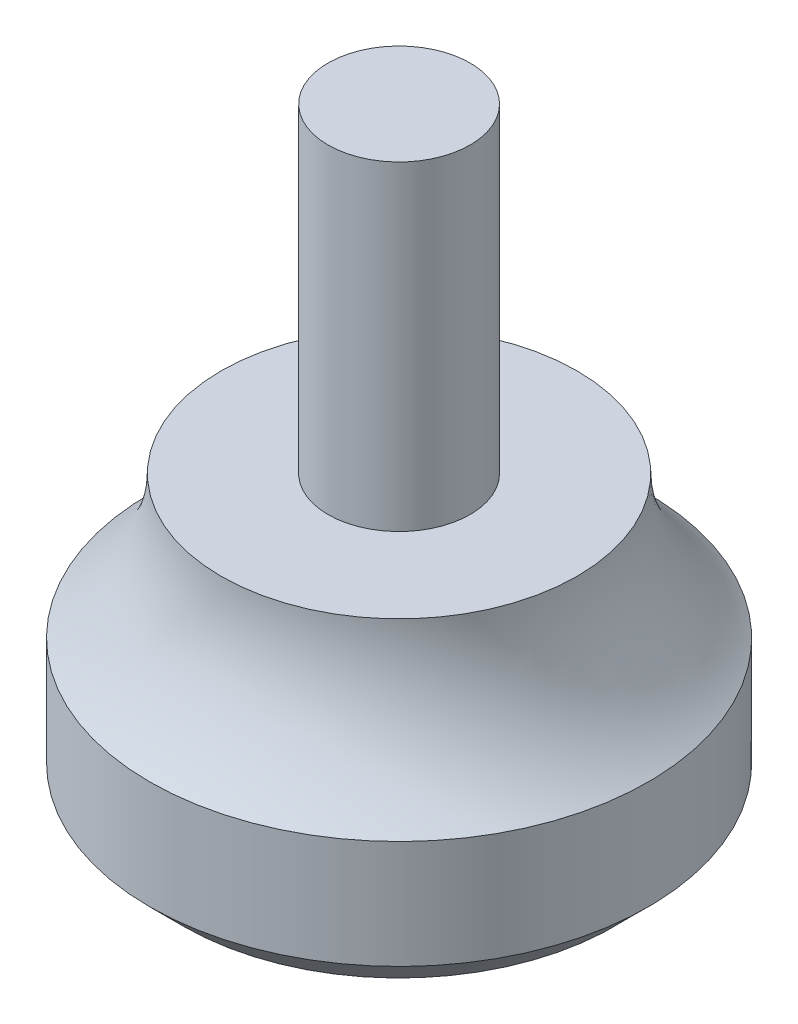
ISO-10303-21;
HEADER;
FILE_DESCRIPTION(('STEP AP214'),'2;1');
FILE_NAME('part.step','',(''),(''),'','','');
FILE_SCHEMA(('AUTOMOTIVE_DESIGN { 1 0 10303 214 1 1 1 1 }'));
ENDSEC;
DATA;
#1=APPLICATION_CONTEXT('core data for automotive mechanical design processes');
#2=APPLICATION_PROTOCOL_DEFINITION('international standard','automotive_design',2000,#1);
#3=PRODUCT_CONTEXT('',#1,'mechanical');
#4=PRODUCT('Part','Part','',(#3));
#5=PRODUCT_RELATED_PRODUCT_CATEGORY('part','',(#4));
#6=PRODUCT_DEFINITION_FORMATION('','',#4);
#7=PRODUCT_DEFINITION_CONTEXT('part definition',#1,'design');
#8=PRODUCT_DEFINITION('design','',#6,#7);
#9=PRODUCT_DEFINITION_SHAPE('','',#8);
#10=(LENGTH_UNIT() NAMED_UNIT(*) SI_UNIT(.MILLI.,.METRE.));
#11=(NAMED_UNIT(*) PLANE_ANGLE_UNIT() SI_UNIT($,.RADIAN.));
#12=(NAMED_UNIT(*) SI_UNIT($,.STERADIAN.) SOLID_ANGLE_UNIT());
#13=UNCERTAINTY_MEASURE_WITH_UNIT(LENGTH_MEASURE(1.E-05),#10,'distance_accuracy_value','');
#14=(GEOMETRIC_REPRESENTATION_CONTEXT(3) GLOBAL_UNCERTAINTY_ASSIGNED_CONTEXT((#13)) GLOBAL_UNIT_ASSIGNED_CONTEXT((#10,
#11,#12)) REPRESENTATION_CONTEXT('',''));
#15=CARTESIAN_POINT('',(0.,0.,0.));
#16=DIRECTION('',(0.,0.,1.));
#17=DIRECTION('',(1.,0.,0.));
#18=AXIS2_PLACEMENT_3D('',#15,#16,#17);
#19=CARTESIAN_POINT('',(0.,0.,0.));
#20=DIRECTION('',(0.,1.,0.));
#21=DIRECTION('',(0.,0.,1.));
#22=AXIS2_PLACEMENT_3D('',#19,#20,#21);
#23=PLANE('',#22);
#24=CARTESIAN_POINT('',(0.,0.,0.));
#25=DIRECTION('',(0.,1.,0.));
#26=DIRECTION('',(0.,0.,1.));
#27=AXIS2_PLACEMENT_3D('',#24,#25,#26);
#28=CIRCLE('',#27,9.59699690485832);
#29=CARTESIAN_POINT('',(0.,0.,9.59699690485832));
#30=VERTEX_POINT('',#29);
#31=EDGE_CURVE('E12',#30,#30,#28,.F.);
#32=ORIENTED_EDGE('',*,*,#31,.T.);
#33=EDGE_LOOP('',(#32));
#34=FACE_BOUND('',#33,.T.);
#35=ADVANCED_FACE('F44',(#34),#23,.F.);
#36=CARTESIAN_POINT('',(3.16865,26.9748,0.));
#37=DIRECTION('',(0.,-1.,0.));
#38=DIRECTION('',(0.,0.,-1.));
#39=AXIS2_PLACEMENT_3D('',#36,#37,#38);
#40=PLANE('',#39);
#41=CARTESIAN_POINT('',(0.,26.9748,0.));
#42=DIRECTION('',(0.,1.,0.));
#43=DIRECTION('',(0.,0.,1.));
#44=AXIS2_PLACEMENT_3D('',#41,#42,#43);
#45=CIRCLE('',#44,3.16865);
#46=CARTESIAN_POINT('',(0.,26.9748,3.16865));
#47=VERTEX_POINT('',#46);
#48=EDGE_CURVE('E55',#47,#47,#45,.T.);
#49=ORIENTED_EDGE('',*,*,#48,.T.);
#50=EDGE_LOOP('',(#49));
#51=FACE_BOUND('',#50,.T.);
#52=ADVANCED_FACE('F85',(#51),#40,.F.);
#53=CARTESIAN_POINT('',(0.,0.,0.));
#54=DIRECTION('',(0.,1.,0.));
#55=DIRECTION('',(0.,0.,1.));
#56=AXIS2_PLACEMENT_3D('',#53,#54,#55);
#57=CYLINDRICAL_SURFACE('',#56,3.16865);
#58=ORIENTED_EDGE('',*,*,#48,.F.);
#59=EDGE_LOOP('',(#58));
#60=FACE_BOUND('',#59,.T.);
#61=CARTESIAN_POINT('',(0.,12.7,0.));
#62=DIRECTION('',(0.,1.,0.));
#63=DIRECTION('',(0.,0.,1.));
#64=AXIS2_PLACEMENT_3D('',#61,#62,#63);
#65=CIRCLE('',#64,3.16865);
#66=CARTESIAN_POINT('',(0.,12.7,3.16865));
#67=VERTEX_POINT('',#66);
#68=EDGE_CURVE('E59',#67,#67,#65,.T.);
#69=ORIENTED_EDGE('',*,*,#68,.T.);
#70=EDGE_LOOP('',(#69));
#71=FACE_BOUND('',#70,.T.);
#72=ADVANCED_FACE('F89',(#60,#71),#57,.T.);
#73=CARTESIAN_POINT('',(7.9375,12.7,0.));
#74=DIRECTION('',(0.,-1.,0.));
#75=DIRECTION('',(0.,0.,-1.));
#76=AXIS2_PLACEMENT_3D('',#73,#74,#75);
#77=PLANE('',#76);
#78=ORIENTED_EDGE('',*,*,#68,.F.);
#79=EDGE_LOOP('',(#78));
#80=FACE_BOUND('',#79,.T.);
#81=CARTESIAN_POINT('',(0.,12.7,0.));
#82=DIRECTION('',(0.,1.,0.));
#83=DIRECTION('',(0.,0.,1.));
#84=AXIS2_PLACEMENT_3D('',#81,#82,#83);
#85=CIRCLE('',#84,7.9375);
#86=CARTESIAN_POINT('',(0.,12.7,7.9375));
#87=VERTEX_POINT('',#86);
#88=EDGE_CURVE('E64',#87,#87,#85,.T.);
#89=ORIENTED_EDGE('',*,*,#88,.T.);
#90=EDGE_LOOP('',(#89));
#91=FACE_BOUND('',#90,.T.);
#92=ADVANCED_FACE('F81',(#80,#91),#77,.F.);
#93=CARTESIAN_POINT('',(0.,12.7,0.));
#94=DIRECTION('',(0.,1.,0.));
#95=DIRECTION('',(0.,0.,1.));
#96=AXIS2_PLACEMENT_3D('',#93,#94,#95);
#97=TOROIDAL_SURFACE('',#96,15.8623,7.9248);
#98=ORIENTED_EDGE('',*,*,#88,.F.);
#99=EDGE_LOOP('',(#98));
#100=FACE_BOUND('',#99,.T.);
#101=CARTESIAN_POINT('',(0.,6.35,0.));
#102=DIRECTION('',(0.,1.,0.));
#103=DIRECTION('',(0.,0.,1.));
#104=AXIS2_PLACEMENT_3D('',#101,#102,#103);
#105=CIRCLE('',#104,11.1209969048583);
#106=CARTESIAN_POINT('',(0.,6.35,11.1209969048583));
#107=VERTEX_POINT('',#106);
#108=EDGE_CURVE('E67',#107,#107,#105,.T.);
#109=ORIENTED_EDGE('',*,*,#108,.T.);
#110=EDGE_LOOP('',(#109));
#111=FACE_BOUND('',#110,.T.);
#112=ADVANCED_FACE('F71',(#100,#111),#97,.F.);
#113=CARTESIAN_POINT('',(0.,0.,0.));
#114=DIRECTION('',(0.,1.,0.));
#115=DIRECTION('',(0.,0.,1.));
#116=AXIS2_PLACEMENT_3D('',#113,#114,#115);
#117=CYLINDRICAL_SURFACE('',#116,11.1209969048583);
#118=CARTESIAN_POINT('',(0.,1.524,0.));
#119=DIRECTION('',(0.,1.,0.));
#120=DIRECTION('',(0.,0.,1.));
#121=AXIS2_PLACEMENT_3D('',#118,#119,#120);
#122=CIRCLE('',#121,11.1209969048583);
#123=CARTESIAN_POINT('',(0.,1.524,11.1209969048583));
#124=VERTEX_POINT('',#123);
#125=EDGE_CURVE('E51',#124,#124,#122,.T.);
#126=ORIENTED_EDGE('',*,*,#125,.T.);
#127=EDGE_LOOP('',(#126));
#128=FACE_BOUND('',#127,.T.);
#129=ORIENTED_EDGE('',*,*,#108,.F.);
#130=EDGE_LOOP('',(#129));
#131=FACE_BOUND('',#130,.T.);
#132=ADVANCED_FACE('F73',(#128,#131),#117,.T.);
#133=CARTESIAN_POINT('',(0.,1.524,0.));
#134=DIRECTION('',(0.,1.,0.));
#135=DIRECTION('',(0.,0.,1.));
#136=AXIS2_PLACEMENT_3D('',#133,#134,#135);
#137=CONICAL_SURFACE('',#136,11.1209969048583,0.785398163397451);
#138=ORIENTED_EDGE('',*,*,#31,.F.);
#139=EDGE_LOOP('',(#138));
#140=FACE_BOUND('',#139,.T.);
#141=ORIENTED_EDGE('',*,*,#125,.F.);
#142=EDGE_LOOP('',(#141));
#143=FACE_BOUND('',#142,.T.);
#144=ADVANCED_FACE('F46',(#140,#143),#137,.T.);
#145=CLOSED_SHELL('',(#35,#52,#72,#92,#112,#132,#144));
#146=MANIFOLD_SOLID_BREP('B2',#145);
#147=ADVANCED_BREP_SHAPE_REPRESENTATION('',(#18,#146),#14);
#148=SHAPE_DEFINITION_REPRESENTATION(#9,#147);
ENDSEC;
END-ISO-10303-21;
